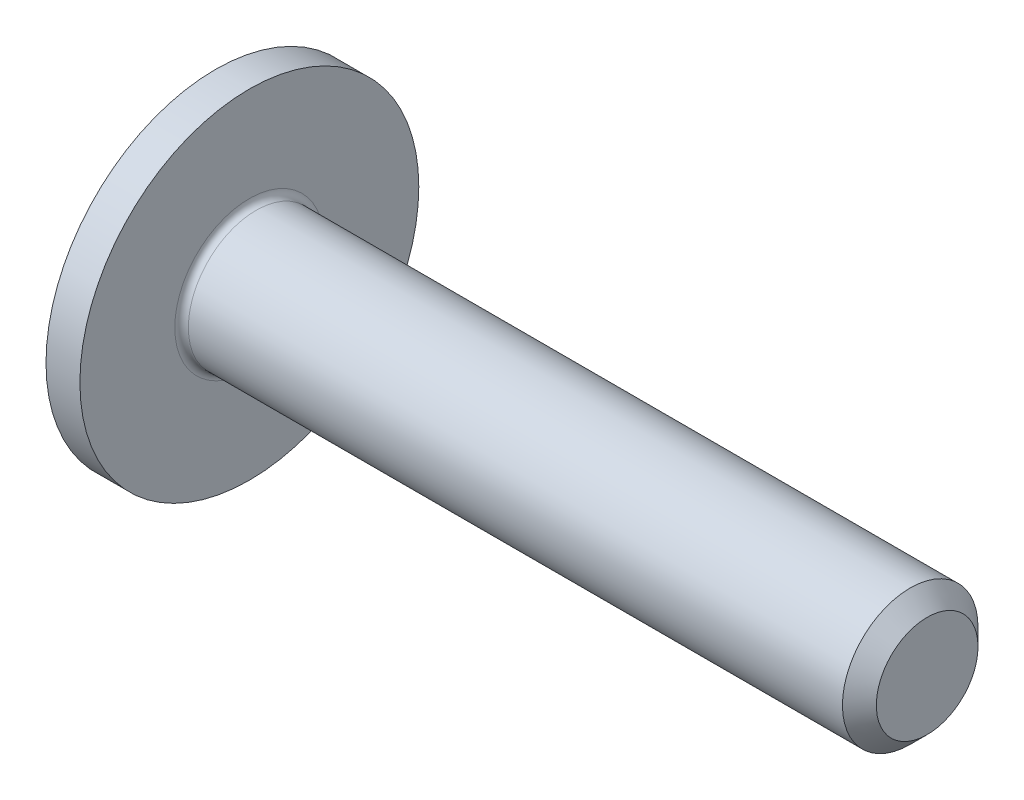
ISO-10303-21;
HEADER;
FILE_DESCRIPTION(('STEP AP214'),'2;1');
FILE_NAME('part.step','',(''),(''),'','','');
FILE_SCHEMA(('AUTOMOTIVE_DESIGN { 1 0 10303 214 1 1 1 1 }'));
ENDSEC;
DATA;
#1=APPLICATION_CONTEXT('core data for automotive mechanical design processes');
#2=APPLICATION_PROTOCOL_DEFINITION('international standard','automotive_design',2000,#1);
#3=PRODUCT_CONTEXT('',#1,'mechanical');
#4=PRODUCT('Part','Part','',(#3));
#5=PRODUCT_RELATED_PRODUCT_CATEGORY('part','',(#4));
#6=PRODUCT_DEFINITION_FORMATION('','',#4);
#7=PRODUCT_DEFINITION_CONTEXT('part definition',#1,'design');
#8=PRODUCT_DEFINITION('design','',#6,#7);
#9=PRODUCT_DEFINITION_SHAPE('','',#8);
#10=(LENGTH_UNIT() NAMED_UNIT(*) SI_UNIT(.MILLI.,.METRE.));
#11=(NAMED_UNIT(*) PLANE_ANGLE_UNIT() SI_UNIT($,.RADIAN.));
#12=(NAMED_UNIT(*) SI_UNIT($,.STERADIAN.) SOLID_ANGLE_UNIT());
#13=UNCERTAINTY_MEASURE_WITH_UNIT(LENGTH_MEASURE(1.E-05),#10,'distance_accuracy_value','');
#14=(GEOMETRIC_REPRESENTATION_CONTEXT(3) GLOBAL_UNCERTAINTY_ASSIGNED_CONTEXT((#13)) GLOBAL_UNIT_ASSIGNED_CONTEXT((#10,
#11,#12)) REPRESENTATION_CONTEXT('',''));
#15=CARTESIAN_POINT('',(0.,0.,0.));
#16=DIRECTION('',(0.,0.,1.));
#17=DIRECTION('',(1.,0.,0.));
#18=AXIS2_PLACEMENT_3D('',#15,#16,#17);
#19=CARTESIAN_POINT('',(5.8,0.,0.));
#20=DIRECTION('',(-1.,0.,0.));
#21=DIRECTION('',(0.,1.,0.));
#22=AXIS2_PLACEMENT_3D('',#19,#20,#21);
#23=SPHERICAL_SURFACE('',#22,5.8);
#24=CARTESIAN_POINT('',(2.05,0.,0.));
#25=DIRECTION('',(1.,0.,0.));
#26=DIRECTION('',(0.,0.,-1.));
#27=AXIS2_PLACEMENT_3D('',#24,#25,#26);
#28=CIRCLE('',#27,4.42464687856557);
#29=CARTESIAN_POINT('',(2.05,0.,-4.42464687856557));
#30=VERTEX_POINT('',#29);
#31=EDGE_CURVE('E424',#30,#30,#28,.F.);
#32=ORIENTED_EDGE('',*,*,#31,.T.);
#33=EDGE_LOOP('',(#32));
#34=FACE_BOUND('',#33,.T.);
#35=CARTESIAN_POINT('',(4.49544161532536,1.48681053180461,1.70147353185102));
#36=DIRECTION('',(0.5,-0.56985204697275,-0.652126248943383));
#37=DIRECTION('',(0.,0.753010530746166,-0.658008465435953));
#38=AXIS2_PLACEMENT_3D('',#35,#36,#37);
#39=CIRCLE('',#38,5.18001058723826);
#40=CARTESIAN_POINT('',(0.350670800180913,1.40442359564326,-1.40442359564326));
#41=VERTEX_POINT('',#40);
#42=CARTESIAN_POINT('',(0.0915426130173634,0.556694252642318,-0.862325791147634));
#43=VERTEX_POINT('',#42);
#44=EDGE_CURVE('E251',#41,#43,#39,.F.);
#45=ORIENTED_EDGE('',*,*,#44,.F.);
#46=CARTESIAN_POINT('',(4.49544161532536,-1.70147353185102,-1.48681053180461));
#47=DIRECTION('',(0.5,0.652126248943383,0.569852046972749));
#48=DIRECTION('',(0.,-0.658008465435952,0.753010530746167));
#49=AXIS2_PLACEMENT_3D('',#46,#47,#48);
#50=CIRCLE('',#49,5.18001058723826);
#51=CARTESIAN_POINT('',(0.0915426130173635,0.862325791147634,-0.556694252642318));
#52=VERTEX_POINT('',#51);
#53=EDGE_CURVE('E247',#52,#41,#50,.F.);
#54=ORIENTED_EDGE('',*,*,#53,.F.);
#55=CARTESIAN_POINT('',(0.0915426130173634,0.,0.));
#56=DIRECTION('',(1.,0.,0.));
#57=DIRECTION('',(0.,0.,-1.));
#58=AXIS2_PLACEMENT_3D('',#55,#56,#57);
#59=CIRCLE('',#58,1.02640842796783);
#60=CARTESIAN_POINT('',(0.0915426130173482,0.891122758840145,-0.509327487654908));
#61=VERTEX_POINT('',#60);
#62=EDGE_CURVE('E244',#61,#52,#59,.F.);
#63=ORIENTED_EDGE('',*,*,#62,.F.);
#64=CARTESIAN_POINT('',(5.80960489391217,0.,-0.155003115548178));
#65=DIRECTION('',(0.0618471864963983,0.,-0.998085630355672));
#66=DIRECTION('',(-0.998085630355672,0.,-0.0618471864963983));
#67=AXIS2_PLACEMENT_3D('',#64,#65,#66);
#68=CIRCLE('',#67,5.79792047032238);
#69=CARTESIAN_POINT('',(0.390286169611535,2.03324772703929,-0.490815600600995));
#70=VERTEX_POINT('',#69);
#71=EDGE_CURVE('E437',#61,#70,#68,.T.);
#72=ORIENTED_EDGE('',*,*,#71,.T.);
#73=CARTESIAN_POINT('',(5.91393656966608,0.380873675740912,0.));
#74=DIRECTION('',(0.286596561114573,0.958051361440137,0.));
#75=DIRECTION('',(-0.958051361440137,0.286596561114573,0.));
#76=AXIS2_PLACEMENT_3D('',#73,#74,#75);
#77=CIRCLE('',#76,5.78635927861555);
#78=CARTESIAN_POINT('',(0.390286169611535,2.03324772703929,0.490815600600995));
#79=VERTEX_POINT('',#78);
#80=EDGE_CURVE('E434',#70,#79,#77,.T.);
#81=ORIENTED_EDGE('',*,*,#80,.T.);
#82=CARTESIAN_POINT('',(5.80960489391217,0.,0.155003115548176));
#83=DIRECTION('',(0.0618471864963987,0.,0.998085630355672));
#84=DIRECTION('',(0.998085630355672,0.,-0.0618471864963988));
#85=AXIS2_PLACEMENT_3D('',#82,#83,#84);
#86=CIRCLE('',#85,5.79792047032238);
#87=CARTESIAN_POINT('',(0.091542613017363,0.891122758839946,0.509327487654907));
#88=VERTEX_POINT('',#87);
#89=EDGE_CURVE('E442',#79,#88,#86,.T.);
#90=ORIENTED_EDGE('',*,*,#89,.T.);
#91=CARTESIAN_POINT('',(0.0915426130173635,0.862325791147634,0.556694252642319));
#92=VERTEX_POINT('',#91);
#93=EDGE_CURVE('E266',#92,#88,#59,.F.);
#94=ORIENTED_EDGE('',*,*,#93,.F.);
#95=CARTESIAN_POINT('',(4.49544161532536,-1.70147353185102,1.48681053180461));
#96=DIRECTION('',(0.5,0.652126248943383,-0.569852046972749));
#97=DIRECTION('',(0.,0.658008465435952,0.753010530746167));
#98=AXIS2_PLACEMENT_3D('',#95,#96,#97);
#99=CIRCLE('',#98,5.18001058723826);
#100=CARTESIAN_POINT('',(0.350670800180913,1.40442359564326,1.40442359564326));
#101=VERTEX_POINT('',#100);
#102=EDGE_CURVE('E252',#101,#92,#99,.F.);
#103=ORIENTED_EDGE('',*,*,#102,.F.);
#104=CARTESIAN_POINT('',(4.49544161532536,1.48681053180461,-1.70147353185102));
#105=DIRECTION('',(0.5,-0.56985204697275,0.652126248943383));
#106=DIRECTION('',(0.,-0.753010530746166,-0.658008465435953));
#107=AXIS2_PLACEMENT_3D('',#104,#105,#106);
#108=CIRCLE('',#107,5.18001058723826);
#109=CARTESIAN_POINT('',(0.0915426130173634,0.556694252642318,0.862325791147634));
#110=VERTEX_POINT('',#109);
#111=EDGE_CURVE('E255',#110,#101,#108,.F.);
#112=ORIENTED_EDGE('',*,*,#111,.F.);
#113=CARTESIAN_POINT('',(0.0915426130173482,0.509327487654905,0.891122758840146));
#114=VERTEX_POINT('',#113);
#115=EDGE_CURVE('E269',#114,#110,#59,.F.);
#116=ORIENTED_EDGE('',*,*,#115,.F.);
#117=CARTESIAN_POINT('',(5.80960489391217,0.155003115548178,0.));
#118=DIRECTION('',(0.0618471864963983,0.998085630355672,0.));
#119=DIRECTION('',(-0.998085630355672,0.0618471864963983,0.));
#120=AXIS2_PLACEMENT_3D('',#117,#118,#119);
#121=CIRCLE('',#120,5.79792047032238);
#122=CARTESIAN_POINT('',(0.390286169611535,0.490815600600988,2.03324772703929));
#123=VERTEX_POINT('',#122);
#124=EDGE_CURVE('E742',#114,#123,#121,.T.);
#125=ORIENTED_EDGE('',*,*,#124,.T.);
#126=CARTESIAN_POINT('',(5.91393656966608,0.,0.380873675740912));
#127=DIRECTION('',(0.286596561114573,0.,0.958051361440137));
#128=DIRECTION('',(0.958051361440137,0.,-0.286596561114573));
#129=AXIS2_PLACEMENT_3D('',#126,#127,#128);
#130=CIRCLE('',#129,5.78635927861555);
#131=CARTESIAN_POINT('',(0.390286169611535,-0.490815600601002,2.03324772703929));
#132=VERTEX_POINT('',#131);
#133=EDGE_CURVE('E448',#123,#132,#130,.T.);
#134=ORIENTED_EDGE('',*,*,#133,.T.);
#135=CARTESIAN_POINT('',(5.80960489391217,-0.155003115548176,0.));
#136=DIRECTION('',(0.0618471864963987,-0.998085630355672,0.));
#137=DIRECTION('',(0.998085630355672,0.0618471864963988,0.));
#138=AXIS2_PLACEMENT_3D('',#135,#136,#137);
#139=CIRCLE('',#138,5.79792047032238);
#140=CARTESIAN_POINT('',(0.0915426130173487,-0.509327487654911,0.891122758840143));
#141=VERTEX_POINT('',#140);
#142=EDGE_CURVE('E746',#132,#141,#139,.T.);
#143=ORIENTED_EDGE('',*,*,#142,.T.);
#144=CARTESIAN_POINT('',(0.0915426130173634,-0.556694252642318,0.862325791147634));
#145=VERTEX_POINT('',#144);
#146=EDGE_CURVE('E715',#145,#141,#59,.F.);
#147=ORIENTED_EDGE('',*,*,#146,.F.);
#148=CARTESIAN_POINT('',(4.49544161532536,-1.48681053180461,-1.70147353185102));
#149=DIRECTION('',(0.5,0.56985204697275,0.652126248943383));
#150=DIRECTION('',(0.,-0.753010530746166,0.658008465435953));
#151=AXIS2_PLACEMENT_3D('',#148,#149,#150);
#152=CIRCLE('',#151,5.18001058723826);
#153=CARTESIAN_POINT('',(0.350670800180913,-1.40442359564326,1.40442359564326));
#154=VERTEX_POINT('',#153);
#155=EDGE_CURVE('E709',#154,#145,#152,.F.);
#156=ORIENTED_EDGE('',*,*,#155,.F.);
#157=CARTESIAN_POINT('',(4.49544161532536,1.70147353185102,1.48681053180461));
#158=DIRECTION('',(0.5,-0.652126248943383,-0.569852046972749));
#159=DIRECTION('',(0.,0.658008465435952,-0.753010530746167));
#160=AXIS2_PLACEMENT_3D('',#157,#158,#159);
#161=CIRCLE('',#160,5.18001058723826);
#162=CARTESIAN_POINT('',(0.0915426130173635,-0.862325791147634,0.556694252642318));
#163=VERTEX_POINT('',#162);
#164=EDGE_CURVE('E703',#163,#154,#161,.F.);
#165=ORIENTED_EDGE('',*,*,#164,.F.);
#166=CARTESIAN_POINT('',(0.091542613017363,-0.891122758839946,0.509327487654907));
#167=VERTEX_POINT('',#166);
#168=EDGE_CURVE('E274',#167,#163,#59,.F.);
#169=ORIENTED_EDGE('',*,*,#168,.F.);
#170=CARTESIAN_POINT('',(0.390286169611531,-2.03324772703928,0.490815600600995));
#171=VERTEX_POINT('',#170);
#172=EDGE_CURVE('E441',#167,#171,#86,.T.);
#173=ORIENTED_EDGE('',*,*,#172,.T.);
#174=CARTESIAN_POINT('',(5.91393656966608,-0.380873675740917,0.));
#175=DIRECTION('',(0.28659656111457,-0.958051361440138,0.));
#176=DIRECTION('',(0.958051361440138,0.28659656111457,0.));
#177=AXIS2_PLACEMENT_3D('',#174,#175,#176);
#178=CIRCLE('',#177,5.78635927861555);
#179=CARTESIAN_POINT('',(0.390286169611531,-2.03324772703928,-0.490815600600995));
#180=VERTEX_POINT('',#179);
#181=EDGE_CURVE('E445',#171,#180,#178,.T.);
#182=ORIENTED_EDGE('',*,*,#181,.T.);
#183=CARTESIAN_POINT('',(0.0915426130173481,-0.891122758840144,-0.509327487654908));
#184=VERTEX_POINT('',#183);
#185=EDGE_CURVE('E438',#180,#184,#68,.T.);
#186=ORIENTED_EDGE('',*,*,#185,.T.);
#187=CARTESIAN_POINT('',(0.0915426130173635,-0.862325791147634,-0.556694252642319));
#188=VERTEX_POINT('',#187);
#189=EDGE_CURVE('E716',#188,#184,#59,.F.);
#190=ORIENTED_EDGE('',*,*,#189,.F.);
#191=CARTESIAN_POINT('',(4.49544161532536,1.70147353185102,-1.48681053180461));
#192=DIRECTION('',(0.5,-0.652126248943383,0.569852046972749));
#193=DIRECTION('',(0.,-0.658008465435952,-0.753010530746167));
#194=AXIS2_PLACEMENT_3D('',#191,#192,#193);
#195=CIRCLE('',#194,5.18001058723826);
#196=CARTESIAN_POINT('',(0.350670800180912,-1.40442359564326,-1.40442359564326));
#197=VERTEX_POINT('',#196);
#198=EDGE_CURVE('E209',#197,#188,#195,.F.);
#199=ORIENTED_EDGE('',*,*,#198,.F.);
#200=CARTESIAN_POINT('',(4.49544161532536,-1.48681053180461,1.70147353185102));
#201=DIRECTION('',(0.5,0.56985204697275,-0.652126248943383));
#202=DIRECTION('',(0.,0.753010530746166,0.658008465435953));
#203=AXIS2_PLACEMENT_3D('',#200,#201,#202);
#204=CIRCLE('',#203,5.18001058723826);
#205=CARTESIAN_POINT('',(0.0915426130173634,-0.556694252642318,-0.862325791147634));
#206=VERTEX_POINT('',#205);
#207=EDGE_CURVE('E219',#206,#197,#204,.F.);
#208=ORIENTED_EDGE('',*,*,#207,.F.);
#209=CARTESIAN_POINT('',(0.0915426130173629,-0.509327487654904,-0.891122758839948));
#210=VERTEX_POINT('',#209);
#211=EDGE_CURVE('E226',#210,#206,#59,.F.);
#212=ORIENTED_EDGE('',*,*,#211,.F.);
#213=CARTESIAN_POINT('',(0.390286169611531,-0.490815600600988,-2.03324772703928));
#214=VERTEX_POINT('',#213);
#215=EDGE_CURVE('E744',#210,#214,#139,.T.);
#216=ORIENTED_EDGE('',*,*,#215,.T.);
#217=CARTESIAN_POINT('',(5.91393656966608,0.,-0.380873675740917));
#218=DIRECTION('',(0.28659656111457,0.,-0.958051361440138));
#219=DIRECTION('',(-0.958051361440138,0.,-0.28659656111457));
#220=AXIS2_PLACEMENT_3D('',#217,#218,#219);
#221=CIRCLE('',#220,5.78635927861555);
#222=CARTESIAN_POINT('',(0.390286169611531,0.490815600601002,-2.03324772703928));
#223=VERTEX_POINT('',#222);
#224=EDGE_CURVE('E450',#214,#223,#221,.T.);
#225=ORIENTED_EDGE('',*,*,#224,.T.);
#226=CARTESIAN_POINT('',(0.0915426130173631,0.50932748765491,-0.891122758839945));
#227=VERTEX_POINT('',#226);
#228=EDGE_CURVE('E740',#223,#227,#121,.T.);
#229=ORIENTED_EDGE('',*,*,#228,.T.);
#230=EDGE_CURVE('E273',#43,#227,#59,.F.);
#231=ORIENTED_EDGE('',*,*,#230,.F.);
#232=EDGE_LOOP('',(#45,#54,#63,#72,#81,#90,#94,#103,#112,#116,#125,#134,#143,#147,#156,#165,
#169,#173,#182,#186,#190,#199,#208,#212,#216,#225,#229,#231));
#233=FACE_BOUND('',#232,.T.);
#234=ADVANCED_FACE('F40',(#34,#233),#23,.T.);
#235=CARTESIAN_POINT('',(2.6,0.,0.));
#236=DIRECTION('',(-1.,0.,0.));
#237=DIRECTION('',(0.,0.,1.));
#238=AXIS2_PLACEMENT_3D('',#235,#236,#237);
#239=CONICAL_SURFACE('',#238,0.850999999999999,0.069813170079766);
#240=CARTESIAN_POINT('',(2.6,0.,0.));
#241=DIRECTION('',(-1.,0.,0.));
#242=DIRECTION('',(0.,0.,1.));
#243=AXIS2_PLACEMENT_3D('',#240,#241,#242);
#244=CIRCLE('',#243,0.850999999999999);
#245=CARTESIAN_POINT('',(2.6,0.,0.850999999999999));
#246=VERTEX_POINT('',#245);
#247=EDGE_CURVE('E260',#246,#246,#244,.T.);
#248=ORIENTED_EDGE('',*,*,#247,.F.);
#249=EDGE_LOOP('',(#248));
#250=FACE_BOUND('',#249,.T.);
#251=CARTESIAN_POINT('',(0.370538725217987,0.0918314341366156,0.0802457051897273));
#252=DIRECTION('',(0.5,0.652126248943383,0.569852046972749));
#253=DIRECTION('',(-0.866025403784438,0.376505265373084,0.329004232717976));
#254=AXIS2_PLACEMENT_3D('',#251,#252,#253);
#255=ELLIPSE('',#254,2.01379823859401,0.999486593679023);
#256=CARTESIAN_POINT('',(0.465382099864509,0.707295596002862,-0.707295596002862));
#257=VERTEX_POINT('',#256);
#258=EDGE_CURVE('E48',#52,#257,#255,.F.);
#259=ORIENTED_EDGE('',*,*,#258,.T.);
#260=CARTESIAN_POINT('',(0.370538725217985,-0.0802457051897277,-0.0918314341366157));
#261=DIRECTION('',(0.5,-0.56985204697275,-0.652126248943383));
#262=DIRECTION('',(-0.866025403784438,-0.329004232717977,-0.376505265373083));
#263=AXIS2_PLACEMENT_3D('',#260,#261,#262);
#264=ELLIPSE('',#263,2.01379823859401,0.999486593679024);
#265=EDGE_CURVE('E11',#257,#43,#264,.F.);
#266=ORIENTED_EDGE('',*,*,#265,.T.);
#267=ORIENTED_EDGE('',*,*,#230,.T.);
#268=CARTESIAN_POINT('',(0.0452078804564265,0.512198656980268,-0.893212462768129));
#269=CARTESIAN_POINT('',(0.365106160426383,0.492375900315463,-0.878790183729411));
#270=CARTESIAN_POINT('',(0.684997245175192,0.472553589508378,-0.864205051965348));
#271=CARTESIAN_POINT('',(1.32476098967625,0.432910109614082,-0.834642123898892));
#272=CARTESIAN_POINT('',(1.64463364944747,0.413088940525694,-0.819664328008124));
#273=CARTESIAN_POINT('',(2.08973198362717,0.385508060843619,-0.798502412906335));
#274=CARTESIAN_POINT('',(2.2149668823717,0.377747778656458,-0.792512888403489));
#275=CARTESIAN_POINT('',(2.3402,0.36998760683761,-0.786486121868666));
#276=B_SPLINE_CURVE_WITH_KNOTS('',3,(#268,#269,#270,#271,#272,#273,#274,#275),.UNSPECIFIED.,.F.,
.F.,(4,2,2,4),(0.,0.962508687501757,1.92501636605824,2.30187028300653),.UNSPECIFIED.);
#277=CARTESIAN_POINT('',(2.34,0.370000000000003,-0.786495747306727));
#278=VERTEX_POINT('',#277);
#279=EDGE_CURVE('E336',#227,#278,#276,.T.);
#280=ORIENTED_EDGE('',*,*,#279,.T.);
#281=CARTESIAN_POINT('',(2.34,0.,0.));
#282=DIRECTION('',(-1.,0.,0.));
#283=DIRECTION('',(0.,0.,1.));
#284=AXIS2_PLACEMENT_3D('',#281,#282,#283);
#285=CIRCLE('',#284,0.86918097110531);
#286=CARTESIAN_POINT('',(2.34,-0.369999999999997,-0.78649574730673));
#287=VERTEX_POINT('',#286);
#288=EDGE_CURVE('E267',#287,#278,#285,.F.);
#289=ORIENTED_EDGE('',*,*,#288,.F.);
#290=CARTESIAN_POINT('',(2.3402,-0.369987606837604,-0.786486121868669));
#291=CARTESIAN_POINT('',(2.07019913746138,-0.386718429516279,-0.799478554072587));
#292=CARTESIAN_POINT('',(1.80019009427807,-0.403449759115245,-0.812299140431048));
#293=CARTESIAN_POINT('',(1.26015794483742,-0.436913289742977,-0.837635105994263));
#294=CARTESIAN_POINT('',(0.990134838591079,-0.453645490771063,-0.850150485434047));
#295=CARTESIAN_POINT('',(0.495143747104779,-0.484318015670855,-0.872848007294731));
#296=CARTESIAN_POINT('',(0.270177625154038,-0.498258224082332,-0.883070947346797));
#297=CARTESIAN_POINT('',(0.0452078804564257,-0.512198656980261,-0.893212462768132));
#298=B_SPLINE_CURVE_WITH_KNOTS('',3,(#290,#291,#292,#293,#294,#295,#296,#297),.UNSPECIFIED.,.F.,
.F.,(4,2,2,4),(0.,0.812491523202115,1.62498242071296,2.30187030608887),.UNSPECIFIED.);
#299=EDGE_CURVE('E341',#287,#210,#298,.T.);
#300=ORIENTED_EDGE('',*,*,#299,.T.);
#301=ORIENTED_EDGE('',*,*,#211,.T.);
#302=CARTESIAN_POINT('',(0.370538725217985,0.0802457051897277,-0.0918314341366157));
#303=DIRECTION('',(0.5,0.56985204697275,-0.652126248943383));
#304=DIRECTION('',(-0.866025403784438,0.329004232717977,-0.376505265373083));
#305=AXIS2_PLACEMENT_3D('',#302,#303,#304);
#306=ELLIPSE('',#305,2.01379823859401,0.999486593679024);
#307=CARTESIAN_POINT('',(0.465382099864508,-0.707295596002862,-0.707295596002861));
#308=VERTEX_POINT('',#307);
#309=EDGE_CURVE('E213',#206,#308,#306,.F.);
#310=ORIENTED_EDGE('',*,*,#309,.T.);
#311=CARTESIAN_POINT('',(0.370538725217986,-0.0918314341366154,0.0802457051897273));
#312=DIRECTION('',(0.5,-0.652126248943383,0.569852046972749));
#313=DIRECTION('',(-0.866025403784438,-0.376505265373084,0.329004232717976));
#314=AXIS2_PLACEMENT_3D('',#311,#312,#313);
#315=ELLIPSE('',#314,2.01379823859401,0.999486593679023);
#316=EDGE_CURVE('E204',#308,#188,#315,.F.);
#317=ORIENTED_EDGE('',*,*,#316,.T.);
#318=ORIENTED_EDGE('',*,*,#189,.T.);
#319=CARTESIAN_POINT('',(0.0452078804564257,-0.89321246276813,-0.512198656980264));
#320=CARTESIAN_POINT('',(0.365106160426382,-0.878790183729412,-0.492375900315459));
#321=CARTESIAN_POINT('',(0.684997245175191,-0.864205051965349,-0.472553589508375));
#322=CARTESIAN_POINT('',(1.32476098967625,-0.834642123898894,-0.432910109614079));
#323=CARTESIAN_POINT('',(1.64463364944747,-0.819664328008126,-0.413088940525692));
#324=CARTESIAN_POINT('',(2.08973198362717,-0.798502412906337,-0.385508060843616));
#325=CARTESIAN_POINT('',(2.2149668823717,-0.792512888403491,-0.377747778656455));
#326=CARTESIAN_POINT('',(2.3402,-0.786486121868667,-0.369987606837608));
#327=B_SPLINE_CURVE_WITH_KNOTS('',3,(#319,#320,#321,#322,#323,#324,#325,#326),.UNSPECIFIED.,.F.,
.F.,(4,2,2,4),(0.,0.962508687501757,1.92501636605824,2.30187028300653),.UNSPECIFIED.);
#328=CARTESIAN_POINT('',(2.34,-0.786495747306728,-0.370000000000001));
#329=VERTEX_POINT('',#328);
#330=EDGE_CURVE('E330',#184,#329,#327,.T.);
#331=ORIENTED_EDGE('',*,*,#330,.T.);
#332=CARTESIAN_POINT('',(2.34,-0.786495747306729,0.37));
#333=VERTEX_POINT('',#332);
#334=EDGE_CURVE('E718',#333,#329,#285,.F.);
#335=ORIENTED_EDGE('',*,*,#334,.F.);
#336=CARTESIAN_POINT('',(2.3402,-0.786486121868668,0.369987606837607));
#337=CARTESIAN_POINT('',(2.07019913746138,-0.799478554072585,0.386718429516281));
#338=CARTESIAN_POINT('',(1.80019009427807,-0.812299140431046,0.403449759115247));
#339=CARTESIAN_POINT('',(1.26015794483742,-0.837635105994262,0.43691328974298));
#340=CARTESIAN_POINT('',(0.990134838591079,-0.850150485434045,0.453645490771066));
#341=CARTESIAN_POINT('',(0.495143747104779,-0.872848007294729,0.484318015670858));
#342=CARTESIAN_POINT('',(0.270177625154038,-0.883070947346795,0.498258224082335));
#343=CARTESIAN_POINT('',(0.0452078804564257,-0.89321246276813,0.512198656980265));
#344=B_SPLINE_CURVE_WITH_KNOTS('',3,(#336,#337,#338,#339,#340,#341,#342,#343),.UNSPECIFIED.,.F.,
.F.,(4,2,2,4),(0.,0.812491523202115,1.62498242071296,2.30187030608887),.UNSPECIFIED.);
#345=EDGE_CURVE('E316',#333,#167,#344,.T.);
#346=ORIENTED_EDGE('',*,*,#345,.T.);
#347=ORIENTED_EDGE('',*,*,#168,.T.);
#348=CARTESIAN_POINT('',(0.370538725217987,-0.0918314341366156,-0.0802457051897273));
#349=DIRECTION('',(0.5,-0.652126248943383,-0.569852046972749));
#350=DIRECTION('',(-0.866025403784438,-0.376505265373084,-0.329004232717976));
#351=AXIS2_PLACEMENT_3D('',#348,#349,#350);
#352=ELLIPSE('',#351,2.01379823859401,0.999486593679023);
#353=CARTESIAN_POINT('',(0.465382099864509,-0.707295596002862,0.707295596002862));
#354=VERTEX_POINT('',#353);
#355=EDGE_CURVE('E227',#163,#354,#352,.F.);
#356=ORIENTED_EDGE('',*,*,#355,.T.);
#357=CARTESIAN_POINT('',(0.370538725217985,0.0802457051897277,0.0918314341366157));
#358=DIRECTION('',(0.5,0.56985204697275,0.652126248943383));
#359=DIRECTION('',(-0.866025403784438,0.329004232717977,0.376505265373083));
#360=AXIS2_PLACEMENT_3D('',#357,#358,#359);
#361=ELLIPSE('',#360,2.01379823859401,0.999486593679024);
#362=EDGE_CURVE('E230',#354,#145,#361,.F.);
#363=ORIENTED_EDGE('',*,*,#362,.T.);
#364=ORIENTED_EDGE('',*,*,#146,.T.);
#365=CARTESIAN_POINT('',(0.0452078804564256,-0.512198656980268,0.893212462768128));
#366=CARTESIAN_POINT('',(0.365106160426382,-0.492375900315462,0.878790183729411));
#367=CARTESIAN_POINT('',(0.684997245175191,-0.472553589508378,0.864205051965348));
#368=CARTESIAN_POINT('',(1.32476098967625,-0.432910109614081,0.834642123898892));
#369=CARTESIAN_POINT('',(1.64463364944747,-0.413088940525694,0.819664328008125));
#370=CARTESIAN_POINT('',(2.08973198362717,-0.385508060843618,0.798502412906336));
#371=CARTESIAN_POINT('',(2.2149668823717,-0.377747778656457,0.79251288840349));
#372=CARTESIAN_POINT('',(2.3402,-0.36998760683761,0.786486121868666));
#373=B_SPLINE_CURVE_WITH_KNOTS('',3,(#365,#366,#367,#368,#369,#370,#371,#372),.UNSPECIFIED.,.F.,
.F.,(4,2,2,4),(0.,0.962508687501757,1.92501636605824,2.30187028300653),.UNSPECIFIED.);
#374=CARTESIAN_POINT('',(2.34,-0.370000000000002,0.786495747306728));
#375=VERTEX_POINT('',#374);
#376=EDGE_CURVE('E272',#141,#375,#373,.T.);
#377=ORIENTED_EDGE('',*,*,#376,.T.);
#378=CARTESIAN_POINT('',(2.34,0.369999999999998,0.78649574730673));
#379=VERTEX_POINT('',#378);
#380=EDGE_CURVE('E263',#379,#375,#285,.F.);
#381=ORIENTED_EDGE('',*,*,#380,.F.);
#382=CARTESIAN_POINT('',(2.3402,0.369987606837605,0.786486121868669));
#383=CARTESIAN_POINT('',(2.07019913746138,0.386718429516279,0.799478554072586));
#384=CARTESIAN_POINT('',(1.80019009427807,0.403449759115245,0.812299140431047));
#385=CARTESIAN_POINT('',(1.26015794483742,0.436913289742977,0.837635105994263));
#386=CARTESIAN_POINT('',(0.990134838591079,0.453645490771063,0.850150485434047));
#387=CARTESIAN_POINT('',(0.495143747104779,0.484318015670855,0.87284800729473));
#388=CARTESIAN_POINT('',(0.270177625154038,0.498258224082332,0.883070947346796));
#389=CARTESIAN_POINT('',(0.0452078804564257,0.512198656980261,0.893212462768132));
#390=B_SPLINE_CURVE_WITH_KNOTS('',3,(#382,#383,#384,#385,#386,#387,#388,#389),.UNSPECIFIED.,.F.,
.F.,(4,2,2,4),(0.,0.812491523202115,1.62498242071296,2.30187030608887),.UNSPECIFIED.);
#391=EDGE_CURVE('E304',#379,#114,#390,.T.);
#392=ORIENTED_EDGE('',*,*,#391,.T.);
#393=ORIENTED_EDGE('',*,*,#115,.T.);
#394=CARTESIAN_POINT('',(0.370538725217985,-0.0802457051897277,0.0918314341366157));
#395=DIRECTION('',(0.5,-0.56985204697275,0.652126248943383));
#396=DIRECTION('',(-0.866025403784438,-0.329004232717977,0.376505265373083));
#397=AXIS2_PLACEMENT_3D('',#394,#395,#396);
#398=ELLIPSE('',#397,2.01379823859401,0.999486593679024);
#399=CARTESIAN_POINT('',(0.465382099864508,0.707295596002861,0.707295596002861));
#400=VERTEX_POINT('',#399);
#401=EDGE_CURVE('E236',#110,#400,#398,.F.);
#402=ORIENTED_EDGE('',*,*,#401,.T.);
#403=CARTESIAN_POINT('',(0.370538725217986,0.0918314341366154,-0.0802457051897273));
#404=DIRECTION('',(0.5,0.652126248943383,-0.569852046972749));
#405=DIRECTION('',(-0.866025403784438,0.376505265373084,-0.329004232717976));
#406=AXIS2_PLACEMENT_3D('',#403,#404,#405);
#407=ELLIPSE('',#406,2.01379823859401,0.999486593679023);
#408=EDGE_CURVE('E239',#400,#92,#407,.F.);
#409=ORIENTED_EDGE('',*,*,#408,.T.);
#410=ORIENTED_EDGE('',*,*,#93,.T.);
#411=CARTESIAN_POINT('',(0.0452078804564257,0.89321246276813,0.512198656980265));
#412=CARTESIAN_POINT('',(0.365106160426382,0.878790183729412,0.492375900315459));
#413=CARTESIAN_POINT('',(0.684997245175191,0.864205051965349,0.472553589508375));
#414=CARTESIAN_POINT('',(1.32476098967625,0.834642123898894,0.432910109614078));
#415=CARTESIAN_POINT('',(1.64463364944747,0.819664328008126,0.413088940525691));
#416=CARTESIAN_POINT('',(2.08973198362717,0.798502412906337,0.385508060843615));
#417=CARTESIAN_POINT('',(2.2149668823717,0.792512888403491,0.377747778656454));
#418=CARTESIAN_POINT('',(2.3402,0.786486121868668,0.369987606837607));
#419=B_SPLINE_CURVE_WITH_KNOTS('',3,(#411,#412,#413,#414,#415,#416,#417,#418),.UNSPECIFIED.,.F.,
.F.,(4,2,2,4),(0.,0.962508687501757,1.92501636605824,2.30187028300653),.UNSPECIFIED.);
#420=CARTESIAN_POINT('',(2.34,0.786495747306729,0.37));
#421=VERTEX_POINT('',#420);
#422=EDGE_CURVE('E282',#88,#421,#419,.T.);
#423=ORIENTED_EDGE('',*,*,#422,.T.);
#424=CARTESIAN_POINT('',(2.34,0.786495747306729,-0.370000000000001));
#425=VERTEX_POINT('',#424);
#426=EDGE_CURVE('E268',#425,#421,#285,.F.);
#427=ORIENTED_EDGE('',*,*,#426,.F.);
#428=CARTESIAN_POINT('',(2.3402,0.786486121868667,-0.369987606837607));
#429=CARTESIAN_POINT('',(2.07019913746138,0.799478554072585,-0.386718429516282));
#430=CARTESIAN_POINT('',(1.80019009427807,0.812299140431046,-0.403449759115248));
#431=CARTESIAN_POINT('',(1.26015794483742,0.837635105994261,-0.43691328974298));
#432=CARTESIAN_POINT('',(0.990134838591079,0.850150485434045,-0.453645490771066));
#433=CARTESIAN_POINT('',(0.495143747104779,0.872848007294729,-0.484318015670858));
#434=CARTESIAN_POINT('',(0.270177625154039,0.883070947346795,-0.498258224082335));
#435=CARTESIAN_POINT('',(0.0452078804564266,0.89321246276813,-0.512198656980264));
#436=B_SPLINE_CURVE_WITH_KNOTS('',3,(#428,#429,#430,#431,#432,#433,#434,#435),.UNSPECIFIED.,.F.,
.F.,(4,2,2,4),(0.,0.812491523202115,1.62498242071296,2.30187030608887),.UNSPECIFIED.);
#437=EDGE_CURVE('E323',#425,#61,#436,.T.);
#438=ORIENTED_EDGE('',*,*,#437,.T.);
#439=ORIENTED_EDGE('',*,*,#62,.T.);
#440=EDGE_LOOP('',(#259,#266,#267,#280,#289,#300,#301,#310,#317,#318,#331,#335,#346,#347,#356,
#363,#364,#377,#381,#392,#393,#402,#409,#410,#423,#427,#438,#439));
#441=FACE_BOUND('',#440,.T.);
#442=ADVANCED_FACE('F224',(#250,#441),#239,.F.);
#443=CARTESIAN_POINT('',(0.,-2.14999999999999,0.515));
#444=DIRECTION('',(0.0618471864963987,0.,0.998085630355672));
#445=DIRECTION('',(0.998085630355672,0.,-0.0618471864963988));
#446=AXIS2_PLACEMENT_3D('',#443,#444,#445);
#447=PLANE('',#446);
#448=ORIENTED_EDGE('',*,*,#345,.F.);
#449=DIRECTION('',(0.,1.,0.));
#450=VECTOR('',#449,1.);
#451=CARTESIAN_POINT('',(2.34,-1.45,0.37));
#452=LINE('',#451,#450);
#453=CARTESIAN_POINT('',(2.34,-1.45,0.37));
#454=VERTEX_POINT('',#453);
#455=EDGE_CURVE('E761',#454,#333,#452,.T.);
#456=ORIENTED_EDGE('',*,*,#455,.F.);
#457=DIRECTION('',(0.956367545721271,0.286092855557643,-0.0592620915083696));
#458=VECTOR('',#457,1.);
#459=CARTESIAN_POINT('',(0.,-2.14999999999999,0.515));
#460=LINE('',#459,#458);
#461=EDGE_CURVE('E542',#171,#454,#460,.T.);
#462=ORIENTED_EDGE('',*,*,#461,.F.);
#463=ORIENTED_EDGE('',*,*,#172,.F.);
#464=EDGE_LOOP('',(#448,#456,#462,#463));
#465=FACE_BOUND('',#464,.T.);
#466=ADVANCED_FACE('F296',(#465),#447,.F.);
#467=CARTESIAN_POINT('',(0.,2.15000000000001,-0.515));
#468=DIRECTION('',(0.0618471864963983,0.,-0.998085630355672));
#469=DIRECTION('',(-0.998085630355672,0.,-0.0618471864963983));
#470=AXIS2_PLACEMENT_3D('',#467,#468,#469);
#471=PLANE('',#470);
#472=ORIENTED_EDGE('',*,*,#330,.F.);
#473=ORIENTED_EDGE('',*,*,#185,.F.);
#474=DIRECTION('',(0.956367545721271,0.286092855557643,0.0592620915083691));
#475=VECTOR('',#474,1.);
#476=CARTESIAN_POINT('',(0.,-2.14999999999999,-0.515));
#477=LINE('',#476,#475);
#478=CARTESIAN_POINT('',(2.34,-1.45,-0.370000000000001));
#479=VERTEX_POINT('',#478);
#480=EDGE_CURVE('E748',#180,#479,#477,.T.);
#481=ORIENTED_EDGE('',*,*,#480,.T.);
#482=DIRECTION('',(0.,-1.,0.));
#483=VECTOR('',#482,1.);
#484=CARTESIAN_POINT('',(2.34,1.45,-0.37));
#485=LINE('',#484,#483);
#486=EDGE_CURVE('E760',#329,#479,#485,.T.);
#487=ORIENTED_EDGE('',*,*,#486,.F.);
#488=EDGE_LOOP('',(#472,#473,#481,#487));
#489=FACE_BOUND('',#488,.T.);
#490=ADVANCED_FACE('F366',(#489),#471,.F.);
#491=ORIENTED_EDGE('',*,*,#422,.F.);
#492=ORIENTED_EDGE('',*,*,#89,.F.);
#493=DIRECTION('',(0.95636754572127,-0.286092855557647,-0.0592620915083695));
#494=VECTOR('',#493,1.);
#495=CARTESIAN_POINT('',(0.,2.15000000000001,0.515));
#496=LINE('',#495,#494);
#497=CARTESIAN_POINT('',(2.34,1.45,0.37));
#498=VERTEX_POINT('',#497);
#499=EDGE_CURVE('E751',#79,#498,#496,.T.);
#500=ORIENTED_EDGE('',*,*,#499,.T.);
#501=EDGE_CURVE('E767',#421,#498,#452,.T.);
#502=ORIENTED_EDGE('',*,*,#501,.F.);
#503=EDGE_LOOP('',(#491,#492,#500,#502));
#504=FACE_BOUND('',#503,.T.);
#505=ADVANCED_FACE('F368',(#504),#447,.F.);
#506=ORIENTED_EDGE('',*,*,#437,.F.);
#507=CARTESIAN_POINT('',(2.34,1.45,-0.37));
#508=VERTEX_POINT('',#507);
#509=EDGE_CURVE('E762',#508,#425,#485,.T.);
#510=ORIENTED_EDGE('',*,*,#509,.F.);
#511=DIRECTION('',(0.95636754572127,-0.286092855557647,0.0592620915083691));
#512=VECTOR('',#511,1.);
#513=CARTESIAN_POINT('',(0.,2.15000000000001,-0.515));
#514=LINE('',#513,#512);
#515=EDGE_CURVE('E754',#70,#508,#514,.T.);
#516=ORIENTED_EDGE('',*,*,#515,.F.);
#517=ORIENTED_EDGE('',*,*,#71,.F.);
#518=EDGE_LOOP('',(#506,#510,#516,#517));
#519=FACE_BOUND('',#518,.T.);
#520=ADVANCED_FACE('F374',(#519),#471,.F.);
#521=CARTESIAN_POINT('',(2.34,1.45,0.37));
#522=DIRECTION('',(-1.,0.,0.));
#523=DIRECTION('',(0.,0.,1.));
#524=AXIS2_PLACEMENT_3D('',#521,#522,#523);
#525=PLANE('',#524);
#526=ORIENTED_EDGE('',*,*,#455,.T.);
#527=ORIENTED_EDGE('',*,*,#334,.T.);
#528=ORIENTED_EDGE('',*,*,#486,.T.);
#529=DIRECTION('',(0.,0.,1.));
#530=VECTOR('',#529,1.);
#531=CARTESIAN_POINT('',(2.34,-1.45,-0.370000000000001));
#532=LINE('',#531,#530);
#533=EDGE_CURVE('E756',#479,#454,#532,.T.);
#534=ORIENTED_EDGE('',*,*,#533,.T.);
#535=EDGE_LOOP('',(#526,#527,#528,#534));
#536=FACE_BOUND('',#535,.T.);
#537=ADVANCED_FACE('F383',(#536),#525,.T.);
#538=DIRECTION('',(0.,0.,1.));
#539=VECTOR('',#538,1.);
#540=CARTESIAN_POINT('',(2.34,-0.369999999999995,-1.45));
#541=LINE('',#540,#539);
#542=CARTESIAN_POINT('',(2.34,-0.369999999999995,-1.45));
#543=VERTEX_POINT('',#542);
#544=EDGE_CURVE('E730',#543,#287,#541,.T.);
#545=ORIENTED_EDGE('',*,*,#544,.T.);
#546=ORIENTED_EDGE('',*,*,#288,.T.);
#547=DIRECTION('',(0.,0.,-1.));
#548=VECTOR('',#547,1.);
#549=CARTESIAN_POINT('',(2.34,0.369999999999995,1.45000000000001));
#550=LINE('',#549,#548);
#551=CARTESIAN_POINT('',(2.34,0.370000000000006,-1.44999999999999));
#552=VERTEX_POINT('',#551);
#553=EDGE_CURVE('E786',#278,#552,#550,.T.);
#554=ORIENTED_EDGE('',*,*,#553,.T.);
#555=DIRECTION('',(0.,-1.,0.));
#556=VECTOR('',#555,1.);
#557=CARTESIAN_POINT('',(2.34,0.370000000000006,-1.44999999999999));
#558=LINE('',#557,#556);
#559=EDGE_CURVE('E738',#552,#543,#558,.T.);
#560=ORIENTED_EDGE('',*,*,#559,.T.);
#561=EDGE_LOOP('',(#545,#546,#554,#560));
#562=FACE_BOUND('',#561,.T.);
#563=ADVANCED_FACE('F577',(#562),#525,.T.);
#564=ORIENTED_EDGE('',*,*,#509,.T.);
#565=ORIENTED_EDGE('',*,*,#426,.T.);
#566=ORIENTED_EDGE('',*,*,#501,.T.);
#567=DIRECTION('',(0.,0.,-1.));
#568=VECTOR('',#567,1.);
#569=CARTESIAN_POINT('',(2.34,1.45,0.37));
#570=LINE('',#569,#568);
#571=EDGE_CURVE('E757',#498,#508,#570,.T.);
#572=ORIENTED_EDGE('',*,*,#571,.T.);
#573=EDGE_LOOP('',(#564,#565,#566,#572));
#574=FACE_BOUND('',#573,.T.);
#575=ADVANCED_FACE('F351',(#574),#525,.T.);
#576=CARTESIAN_POINT('',(0.,0.514999999999992,2.15000000000001));
#577=DIRECTION('',(0.0618471864963983,0.998085630355672,0.));
#578=DIRECTION('',(-0.998085630355672,0.0618471864963983,0.));
#579=AXIS2_PLACEMENT_3D('',#576,#577,#578);
#580=PLANE('',#579);
#581=ORIENTED_EDGE('',*,*,#279,.F.);
#582=ORIENTED_EDGE('',*,*,#228,.F.);
#583=DIRECTION('',(0.956367545721271,-0.0592620915083701,0.286092855557643));
#584=VECTOR('',#583,1.);
#585=CARTESIAN_POINT('',(0.,0.515000000000008,-2.14999999999999));
#586=LINE('',#585,#584);
#587=EDGE_CURVE('E779',#223,#552,#586,.T.);
#588=ORIENTED_EDGE('',*,*,#587,.T.);
#589=ORIENTED_EDGE('',*,*,#553,.F.);
#590=EDGE_LOOP('',(#581,#582,#588,#589));
#591=FACE_BOUND('',#590,.T.);
#592=ADVANCED_FACE('F347',(#591),#580,.F.);
#593=CARTESIAN_POINT('',(0.,-0.514999999999993,-2.14999999999999));
#594=DIRECTION('',(0.0618471864963987,-0.998085630355672,0.));
#595=DIRECTION('',(0.998085630355672,0.0618471864963988,0.));
#596=AXIS2_PLACEMENT_3D('',#593,#594,#595);
#597=PLANE('',#596);
#598=ORIENTED_EDGE('',*,*,#299,.F.);
#599=ORIENTED_EDGE('',*,*,#544,.F.);
#600=DIRECTION('',(0.956367545721271,0.0592620915083686,0.286092855557644));
#601=VECTOR('',#600,1.);
#602=CARTESIAN_POINT('',(0.,-0.514999999999993,-2.14999999999999));
#603=LINE('',#602,#601);
#604=EDGE_CURVE('E743',#214,#543,#603,.T.);
#605=ORIENTED_EDGE('',*,*,#604,.F.);
#606=ORIENTED_EDGE('',*,*,#215,.F.);
#607=EDGE_LOOP('',(#598,#599,#605,#606));
#608=FACE_BOUND('',#607,.T.);
#609=ADVANCED_FACE('F289',(#608),#597,.F.);
#610=ORIENTED_EDGE('',*,*,#376,.F.);
#611=ORIENTED_EDGE('',*,*,#142,.F.);
#612=DIRECTION('',(0.95636754572127,0.0592620915083705,-0.286092855557646));
#613=VECTOR('',#612,1.);
#614=CARTESIAN_POINT('',(0.,-0.515000000000008,2.15000000000001));
#615=LINE('',#614,#613);
#616=CARTESIAN_POINT('',(2.34,-0.370000000000005,1.45));
#617=VERTEX_POINT('',#616);
#618=EDGE_CURVE('E776',#132,#617,#615,.T.);
#619=ORIENTED_EDGE('',*,*,#618,.T.);
#620=EDGE_CURVE('E728',#375,#617,#541,.T.);
#621=ORIENTED_EDGE('',*,*,#620,.F.);
#622=EDGE_LOOP('',(#610,#611,#619,#621));
#623=FACE_BOUND('',#622,.T.);
#624=ADVANCED_FACE('F600',(#623),#597,.F.);
#625=ORIENTED_EDGE('',*,*,#391,.F.);
#626=CARTESIAN_POINT('',(2.34,0.369999999999995,1.45000000000001));
#627=VERTEX_POINT('',#626);
#628=EDGE_CURVE('E787',#627,#379,#550,.T.);
#629=ORIENTED_EDGE('',*,*,#628,.F.);
#630=DIRECTION('',(0.95636754572127,-0.0592620915083681,-0.286092855557647));
#631=VECTOR('',#630,1.);
#632=CARTESIAN_POINT('',(0.,0.514999999999992,2.15000000000001));
#633=LINE('',#632,#631);
#634=EDGE_CURVE('E780',#123,#627,#633,.T.);
#635=ORIENTED_EDGE('',*,*,#634,.F.);
#636=ORIENTED_EDGE('',*,*,#124,.F.);
#637=EDGE_LOOP('',(#625,#629,#635,#636));
#638=FACE_BOUND('',#637,.T.);
#639=ADVANCED_FACE('F353',(#638),#580,.F.);
#640=CARTESIAN_POINT('',(-6.34999999999999,0.,0.));
#641=DIRECTION('',(-1.,0.,0.));
#642=DIRECTION('',(0.,0.,1.));
#643=AXIS2_PLACEMENT_3D('',#640,#641,#642);
#644=CYLINDRICAL_SURFACE('',#643,2.00000000000001);
#645=CARTESIAN_POINT('',(22.55,0.,0.));
#646=DIRECTION('',(1.,0.,0.));
#647=DIRECTION('',(0.,0.,-1.));
#648=AXIS2_PLACEMENT_3D('',#645,#646,#647);
#649=CIRCLE('',#648,2.00000000000001);
#650=CARTESIAN_POINT('',(22.55,0.,-2.00000000000001));
#651=VERTEX_POINT('',#650);
#652=EDGE_CURVE('E454',#651,#651,#649,.F.);
#653=ORIENTED_EDGE('',*,*,#652,.T.);
#654=EDGE_LOOP('',(#653));
#655=FACE_BOUND('',#654,.T.);
#656=CARTESIAN_POINT('',(3.25,0.,0.));
#657=DIRECTION('',(-1.,0.,0.));
#658=DIRECTION('',(0.,0.,1.));
#659=AXIS2_PLACEMENT_3D('',#656,#657,#658);
#660=CIRCLE('',#659,2.00000000000001);
#661=CARTESIAN_POINT('',(3.25,0.,2.00000000000001));
#662=VERTEX_POINT('',#661);
#663=EDGE_CURVE('E413',#662,#662,#660,.F.);
#664=ORIENTED_EDGE('',*,*,#663,.T.);
#665=EDGE_LOOP('',(#664));
#666=FACE_BOUND('',#665,.T.);
#667=ADVANCED_FACE('F402',(#655,#666),#644,.T.);
#668=CARTESIAN_POINT('',(23.05,2.00000000000001,0.));
#669=DIRECTION('',(1.,0.,0.));
#670=DIRECTION('',(0.,0.,-1.));
#671=AXIS2_PLACEMENT_3D('',#668,#669,#670);
#672=PLANE('',#671);
#673=CARTESIAN_POINT('',(23.05,0.,0.));
#674=DIRECTION('',(1.,0.,0.));
#675=DIRECTION('',(0.,0.,-1.));
#676=AXIS2_PLACEMENT_3D('',#673,#674,#675);
#677=CIRCLE('',#676,1.50000000000001);
#678=CARTESIAN_POINT('',(23.05,0.,-1.50000000000001));
#679=VERTEX_POINT('',#678);
#680=EDGE_CURVE('E214',#679,#679,#677,.T.);
#681=ORIENTED_EDGE('',*,*,#680,.T.);
#682=EDGE_LOOP('',(#681));
#683=FACE_BOUND('',#682,.T.);
#684=ADVANCED_FACE('F398',(#683),#672,.T.);
#685=CARTESIAN_POINT('',(2.05,5.,0.));
#686=DIRECTION('',(1.,0.,0.));
#687=DIRECTION('',(0.,0.,-1.));
#688=AXIS2_PLACEMENT_3D('',#685,#686,#687);
#689=PLANE('',#688);
#690=ORIENTED_EDGE('',*,*,#31,.F.);
#691=EDGE_LOOP('',(#690));
#692=FACE_BOUND('',#691,.T.);
#693=CARTESIAN_POINT('',(2.05,0.,0.));
#694=DIRECTION('',(-1.,0.,0.));
#695=DIRECTION('',(0.,0.,1.));
#696=AXIS2_PLACEMENT_3D('',#693,#694,#695);
#697=CIRCLE('',#696,5.);
#698=CARTESIAN_POINT('',(2.05,0.,5.));
#699=VERTEX_POINT('',#698);
#700=EDGE_CURVE('E418',#699,#699,#697,.T.);
#701=ORIENTED_EDGE('',*,*,#700,.T.);
#702=EDGE_LOOP('',(#701));
#703=FACE_BOUND('',#702,.T.);
#704=ADVANCED_FACE('F394',(#692,#703),#689,.F.);
#705=CARTESIAN_POINT('',(-6.34999999999999,0.,0.));
#706=DIRECTION('',(-1.,0.,0.));
#707=DIRECTION('',(0.,0.,1.));
#708=AXIS2_PLACEMENT_3D('',#705,#706,#707);
#709=CYLINDRICAL_SURFACE('',#708,5.);
#710=ORIENTED_EDGE('',*,*,#700,.F.);
#711=EDGE_LOOP('',(#710));
#712=FACE_BOUND('',#711,.T.);
#713=CARTESIAN_POINT('',(3.05,0.,0.));
#714=DIRECTION('',(-1.,0.,0.));
#715=DIRECTION('',(0.,0.,1.));
#716=AXIS2_PLACEMENT_3D('',#713,#714,#715);
#717=CIRCLE('',#716,5.);
#718=CARTESIAN_POINT('',(3.05,0.,5.));
#719=VERTEX_POINT('',#718);
#720=EDGE_CURVE('E428',#719,#719,#717,.T.);
#721=ORIENTED_EDGE('',*,*,#720,.T.);
#722=EDGE_LOOP('',(#721));
#723=FACE_BOUND('',#722,.T.);
#724=ADVANCED_FACE('F390',(#712,#723),#709,.T.);
#725=CARTESIAN_POINT('',(3.05,2.,0.));
#726=DIRECTION('',(-1.,0.,0.));
#727=DIRECTION('',(0.,0.,1.));
#728=AXIS2_PLACEMENT_3D('',#725,#726,#727);
#729=PLANE('',#728);
#730=CARTESIAN_POINT('',(3.05,0.,0.));
#731=DIRECTION('',(-1.,0.,0.));
#732=DIRECTION('',(0.,0.,1.));
#733=AXIS2_PLACEMENT_3D('',#730,#731,#732);
#734=CIRCLE('',#733,2.20000000000001);
#735=CARTESIAN_POINT('',(3.05,0.,2.20000000000001));
#736=VERTEX_POINT('',#735);
#737=EDGE_CURVE('E416',#736,#736,#734,.T.);
#738=ORIENTED_EDGE('',*,*,#737,.T.);
#739=EDGE_LOOP('',(#738));
#740=FACE_BOUND('',#739,.T.);
#741=ORIENTED_EDGE('',*,*,#720,.F.);
#742=EDGE_LOOP('',(#741));
#743=FACE_BOUND('',#742,.T.);
#744=ADVANCED_FACE('F387',(#740,#743),#729,.F.);
#745=CARTESIAN_POINT('',(3.25,0.,0.));
#746=DIRECTION('',(-1.,0.,0.));
#747=DIRECTION('',(0.,0.,1.));
#748=AXIS2_PLACEMENT_3D('',#745,#746,#747);
#749=TOROIDAL_SURFACE('',#748,2.20000000000001,0.2);
#750=ORIENTED_EDGE('',*,*,#663,.F.);
#751=EDGE_LOOP('',(#750));
#752=FACE_BOUND('',#751,.T.);
#753=ORIENTED_EDGE('',*,*,#737,.F.);
#754=EDGE_LOOP('',(#753));
#755=FACE_BOUND('',#754,.T.);
#756=ADVANCED_FACE('F362',(#752,#755),#749,.F.);
#757=CARTESIAN_POINT('',(2.34,-1.45,-0.370000000000001));
#758=DIRECTION('',(0.28659656111457,-0.958051361440138,0.));
#759=DIRECTION('',(0.958051361440138,0.28659656111457,0.));
#760=AXIS2_PLACEMENT_3D('',#757,#758,#759);
#761=PLANE('',#760);
#762=ORIENTED_EDGE('',*,*,#461,.T.);
#763=ORIENTED_EDGE('',*,*,#533,.F.);
#764=ORIENTED_EDGE('',*,*,#480,.F.);
#765=ORIENTED_EDGE('',*,*,#181,.F.);
#766=EDGE_LOOP('',(#762,#763,#764,#765));
#767=FACE_BOUND('',#766,.T.);
#768=ADVANCED_FACE('F359',(#767),#761,.F.);
#769=CARTESIAN_POINT('',(2.34,1.45,0.37));
#770=DIRECTION('',(0.286596561114573,0.958051361440137,0.));
#771=DIRECTION('',(-0.958051361440137,0.286596561114573,0.));
#772=AXIS2_PLACEMENT_3D('',#769,#770,#771);
#773=PLANE('',#772);
#774=ORIENTED_EDGE('',*,*,#515,.T.);
#775=ORIENTED_EDGE('',*,*,#571,.F.);
#776=ORIENTED_EDGE('',*,*,#499,.F.);
#777=ORIENTED_EDGE('',*,*,#80,.F.);
#778=EDGE_LOOP('',(#774,#775,#776,#777));
#779=FACE_BOUND('',#778,.T.);
#780=ADVANCED_FACE('F361',(#779),#773,.F.);
#781=ORIENTED_EDGE('',*,*,#628,.T.);
#782=ORIENTED_EDGE('',*,*,#380,.T.);
#783=ORIENTED_EDGE('',*,*,#620,.T.);
#784=DIRECTION('',(0.,1.,0.));
#785=VECTOR('',#784,1.);
#786=CARTESIAN_POINT('',(2.34,-0.370000000000005,1.45));
#787=LINE('',#786,#785);
#788=EDGE_CURVE('E735',#617,#627,#787,.T.);
#789=ORIENTED_EDGE('',*,*,#788,.T.);
#790=EDGE_LOOP('',(#781,#782,#783,#789));
#791=FACE_BOUND('',#790,.T.);
#792=ADVANCED_FACE('F378',(#791),#525,.T.);
#793=CARTESIAN_POINT('',(2.34,0.370000000000006,-1.44999999999999));
#794=DIRECTION('',(0.28659656111457,0.,-0.958051361440138));
#795=DIRECTION('',(0.958051361440138,0.,0.28659656111457));
#796=AXIS2_PLACEMENT_3D('',#793,#794,#795);
#797=PLANE('',#796);
#798=ORIENTED_EDGE('',*,*,#604,.T.);
#799=ORIENTED_EDGE('',*,*,#559,.F.);
#800=ORIENTED_EDGE('',*,*,#587,.F.);
#801=ORIENTED_EDGE('',*,*,#224,.F.);
#802=EDGE_LOOP('',(#798,#799,#800,#801));
#803=FACE_BOUND('',#802,.T.);
#804=ADVANCED_FACE('F300',(#803),#797,.F.);
#805=CARTESIAN_POINT('',(2.34,-0.370000000000005,1.45));
#806=DIRECTION('',(0.286596561114573,0.,0.958051361440137));
#807=DIRECTION('',(-0.958051361440137,0.,0.286596561114573));
#808=AXIS2_PLACEMENT_3D('',#805,#806,#807);
#809=PLANE('',#808);
#810=ORIENTED_EDGE('',*,*,#634,.T.);
#811=ORIENTED_EDGE('',*,*,#788,.F.);
#812=ORIENTED_EDGE('',*,*,#618,.F.);
#813=ORIENTED_EDGE('',*,*,#133,.F.);
#814=EDGE_LOOP('',(#810,#811,#812,#813));
#815=FACE_BOUND('',#814,.T.);
#816=ADVANCED_FACE('F354',(#815),#809,.F.);
#817=CARTESIAN_POINT('',(2.8765066614942,0.,0.));
#818=DIRECTION('',(-1.,0.,0.));
#819=DIRECTION('',(0.,0.,1.));
#820=AXIS2_PLACEMENT_3D('',#817,#818,#819);
#821=CONICAL_SURFACE('',#820,0.,1.25663706143592);
#822=ORIENTED_EDGE('',*,*,#247,.T.);
#823=EDGE_LOOP('',(#822));
#824=FACE_BOUND('',#823,.T.);
#825=CARTESIAN_POINT('',(2.8765066614942,0.,0.));
#826=VERTEX_POINT('',#825);
#827=VERTEX_LOOP('',#826);
#828=FACE_BOUND('',#827,.T.);
#829=ADVANCED_FACE('F298',(#824,#828),#821,.F.);
#830=CARTESIAN_POINT('',(22.55,0.,0.));
#831=DIRECTION('',(-1.,0.,0.));
#832=DIRECTION('',(0.,0.,1.));
#833=AXIS2_PLACEMENT_3D('',#830,#831,#832);
#834=CONICAL_SURFACE('',#833,2.00000000000001,0.785398163397453);
#835=ORIENTED_EDGE('',*,*,#680,.F.);
#836=EDGE_LOOP('',(#835));
#837=FACE_BOUND('',#836,.T.);
#838=ORIENTED_EDGE('',*,*,#652,.F.);
#839=EDGE_LOOP('',(#838));
#840=FACE_BOUND('',#839,.T.);
#841=ADVANCED_FACE('F42',(#837,#840),#834,.T.);
#842=CARTESIAN_POINT('',(0.,-0.446053553467662,0.));
#843=DIRECTION('',(0.5,-0.652126248943383,0.569852046972749));
#844=DIRECTION('',(0.,-0.658008465435952,-0.753010530746167));
#845=AXIS2_PLACEMENT_3D('',#842,#843,#844);
#846=PLANE('',#845);
#847=ORIENTED_EDGE('',*,*,#198,.T.);
#848=ORIENTED_EDGE('',*,*,#316,.F.);
#849=DIRECTION('',(-0.11557359946062,-0.702368401591257,-0.702368401591258));
#850=VECTOR('',#849,1.);
#851=CARTESIAN_POINT('',(0.,-3.53553390593274,-3.53553390593274));
#852=LINE('',#851,#850);
#853=EDGE_CURVE('E207',#308,#197,#852,.T.);
#854=ORIENTED_EDGE('',*,*,#853,.T.);
#855=EDGE_LOOP('',(#847,#848,#854));
#856=FACE_BOUND('',#855,.T.);
#857=ADVANCED_FACE('F206',(#856),#846,.F.);
#858=CARTESIAN_POINT('',(0.,-3.53553390593274,-3.53553390593274));
#859=DIRECTION('',(0.5,0.56985204697275,-0.652126248943383));
#860=DIRECTION('',(0.,0.753010530746166,0.658008465435953));
#861=AXIS2_PLACEMENT_3D('',#858,#859,#860);
#862=PLANE('',#861);
#863=ORIENTED_EDGE('',*,*,#207,.T.);
#864=ORIENTED_EDGE('',*,*,#853,.F.);
#865=ORIENTED_EDGE('',*,*,#309,.F.);
#866=EDGE_LOOP('',(#863,#864,#865));
#867=FACE_BOUND('',#866,.T.);
#868=ADVANCED_FACE('F217',(#867),#862,.F.);
#869=CARTESIAN_POINT('',(0.,-3.53553390593274,3.53553390593274));
#870=DIRECTION('',(0.5,-0.652126248943383,-0.569852046972749));
#871=DIRECTION('',(0.,0.658008465435952,-0.753010530746167));
#872=AXIS2_PLACEMENT_3D('',#869,#870,#871);
#873=PLANE('',#872);
#874=ORIENTED_EDGE('',*,*,#164,.T.);
#875=DIRECTION('',(-0.11557359946062,-0.702368401591257,0.702368401591258));
#876=VECTOR('',#875,1.);
#877=CARTESIAN_POINT('',(0.,-3.53553390593274,3.53553390593274));
#878=LINE('',#877,#876);
#879=EDGE_CURVE('E220',#354,#154,#878,.T.);
#880=ORIENTED_EDGE('',*,*,#879,.F.);
#881=ORIENTED_EDGE('',*,*,#355,.F.);
#882=EDGE_LOOP('',(#874,#880,#881));
#883=FACE_BOUND('',#882,.T.);
#884=ADVANCED_FACE('F643',(#883),#873,.F.);
#885=CARTESIAN_POINT('',(0.,0.,0.446053553467662));
#886=DIRECTION('',(0.5,0.56985204697275,0.652126248943383));
#887=DIRECTION('',(0.,-0.753010530746166,0.658008465435953));
#888=AXIS2_PLACEMENT_3D('',#885,#886,#887);
#889=PLANE('',#888);
#890=ORIENTED_EDGE('',*,*,#155,.T.);
#891=ORIENTED_EDGE('',*,*,#362,.F.);
#892=ORIENTED_EDGE('',*,*,#879,.T.);
#893=EDGE_LOOP('',(#890,#891,#892));
#894=FACE_BOUND('',#893,.T.);
#895=ADVANCED_FACE('F651',(#894),#889,.F.);
#896=CARTESIAN_POINT('',(0.,3.53553390593274,3.53553390593274));
#897=DIRECTION('',(0.5,-0.56985204697275,0.652126248943383));
#898=DIRECTION('',(0.,-0.753010530746166,-0.658008465435953));
#899=AXIS2_PLACEMENT_3D('',#896,#897,#898);
#900=PLANE('',#899);
#901=ORIENTED_EDGE('',*,*,#111,.T.);
#902=DIRECTION('',(-0.11557359946062,0.702368401591257,0.702368401591258));
#903=VECTOR('',#902,1.);
#904=CARTESIAN_POINT('',(0.,3.53553390593274,3.53553390593274));
#905=LINE('',#904,#903);
#906=EDGE_CURVE('E63',#400,#101,#905,.T.);
#907=ORIENTED_EDGE('',*,*,#906,.F.);
#908=ORIENTED_EDGE('',*,*,#401,.F.);
#909=EDGE_LOOP('',(#901,#907,#908));
#910=FACE_BOUND('',#909,.T.);
#911=ADVANCED_FACE('F660',(#910),#900,.F.);
#912=CARTESIAN_POINT('',(0.,0.446053553467662,0.));
#913=DIRECTION('',(0.5,0.652126248943383,-0.569852046972749));
#914=DIRECTION('',(0.,0.658008465435952,0.753010530746167));
#915=AXIS2_PLACEMENT_3D('',#912,#913,#914);
#916=PLANE('',#915);
#917=ORIENTED_EDGE('',*,*,#102,.T.);
#918=ORIENTED_EDGE('',*,*,#408,.F.);
#919=ORIENTED_EDGE('',*,*,#906,.T.);
#920=EDGE_LOOP('',(#917,#918,#919));
#921=FACE_BOUND('',#920,.T.);
#922=ADVANCED_FACE('F669',(#921),#916,.F.);
#923=CARTESIAN_POINT('',(0.,0.,-0.446053553467662));
#924=DIRECTION('',(0.5,-0.56985204697275,-0.652126248943383));
#925=DIRECTION('',(0.,0.753010530746166,-0.658008465435953));
#926=AXIS2_PLACEMENT_3D('',#923,#924,#925);
#927=PLANE('',#926);
#928=ORIENTED_EDGE('',*,*,#44,.T.);
#929=ORIENTED_EDGE('',*,*,#265,.F.);
#930=DIRECTION('',(-0.11557359946062,0.702368401591257,-0.702368401591258));
#931=VECTOR('',#930,1.);
#932=CARTESIAN_POINT('',(0.,3.53553390593274,-3.53553390593274));
#933=LINE('',#932,#931);
#934=EDGE_CURVE('E55',#257,#41,#933,.T.);
#935=ORIENTED_EDGE('',*,*,#934,.T.);
#936=EDGE_LOOP('',(#928,#929,#935));
#937=FACE_BOUND('',#936,.T.);
#938=ADVANCED_FACE('F677',(#937),#927,.F.);
#939=CARTESIAN_POINT('',(0.,3.53553390593274,-3.53553390593274));
#940=DIRECTION('',(0.5,0.652126248943383,0.569852046972749));
#941=DIRECTION('',(0.,-0.658008465435952,0.753010530746167));
#942=AXIS2_PLACEMENT_3D('',#939,#940,#941);
#943=PLANE('',#942);
#944=ORIENTED_EDGE('',*,*,#53,.T.);
#945=ORIENTED_EDGE('',*,*,#934,.F.);
#946=ORIENTED_EDGE('',*,*,#258,.F.);
#947=EDGE_LOOP('',(#944,#945,#946));
#948=FACE_BOUND('',#947,.T.);
#949=ADVANCED_FACE('F246',(#948),#943,.F.);
#950=CLOSED_SHELL('',(#234,#442,#466,#490,#505,#520,#537,#563,#575,#592,#609,#624,#639,#667,
#684,#704,#724,#744,#756,#768,#780,#792,#804,#816,#829,#841,#857,#868,#884,#895,#911,#922,#938,#949));
#951=MANIFOLD_SOLID_BREP('B2',#950);
#952=ADVANCED_BREP_SHAPE_REPRESENTATION('',(#18,#951),#14);
#953=SHAPE_DEFINITION_REPRESENTATION(#9,#952);
ENDSEC;
END-ISO-10303-21;
